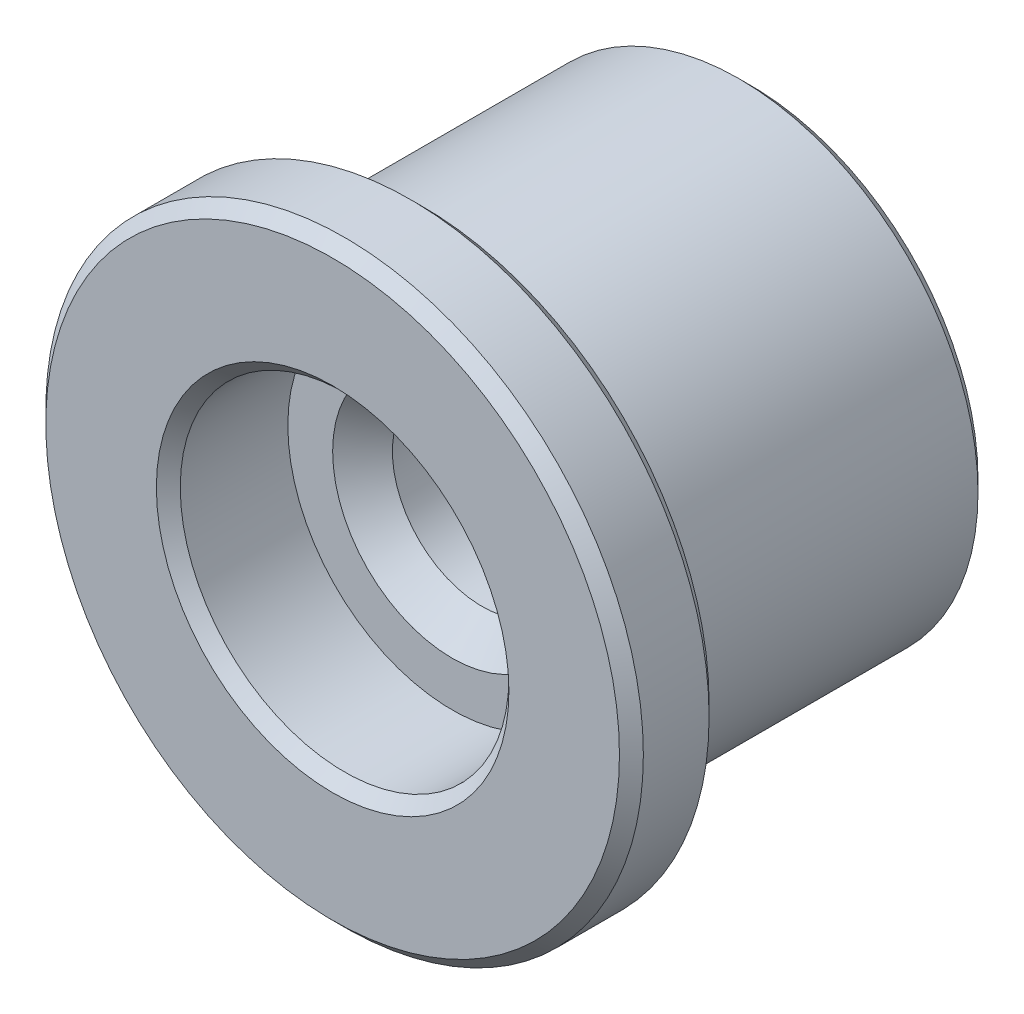
ISO-10303-21;
HEADER;
FILE_DESCRIPTION(('STEP AP214'),'2;1');
FILE_NAME('part.step','',(''),(''),'','','');
FILE_SCHEMA(('AUTOMOTIVE_DESIGN { 1 0 10303 214 1 1 1 1 }'));
ENDSEC;
DATA;
#1=APPLICATION_CONTEXT('core data for automotive mechanical design processes');
#2=APPLICATION_PROTOCOL_DEFINITION('international standard','automotive_design',2000,#1);
#3=PRODUCT_CONTEXT('',#1,'mechanical');
#4=PRODUCT('Part','Part','',(#3));
#5=PRODUCT_RELATED_PRODUCT_CATEGORY('part','',(#4));
#6=PRODUCT_DEFINITION_FORMATION('','',#4);
#7=PRODUCT_DEFINITION_CONTEXT('part definition',#1,'design');
#8=PRODUCT_DEFINITION('design','',#6,#7);
#9=PRODUCT_DEFINITION_SHAPE('','',#8);
#10=(LENGTH_UNIT() NAMED_UNIT(*) SI_UNIT(.MILLI.,.METRE.));
#11=(NAMED_UNIT(*) PLANE_ANGLE_UNIT() SI_UNIT($,.RADIAN.));
#12=(NAMED_UNIT(*) SI_UNIT($,.STERADIAN.) SOLID_ANGLE_UNIT());
#13=UNCERTAINTY_MEASURE_WITH_UNIT(LENGTH_MEASURE(1.E-05),#10,'distance_accuracy_value','');
#14=(GEOMETRIC_REPRESENTATION_CONTEXT(3) GLOBAL_UNCERTAINTY_ASSIGNED_CONTEXT((#13)) GLOBAL_UNIT_ASSIGNED_CONTEXT((#10,
#11,#12)) REPRESENTATION_CONTEXT('',''));
#15=CARTESIAN_POINT('',(0.,0.,0.));
#16=DIRECTION('',(0.,0.,1.));
#17=DIRECTION('',(1.,0.,0.));
#18=AXIS2_PLACEMENT_3D('',#15,#16,#17);
#19=CARTESIAN_POINT('',(0.,0.,5.5));
#20=DIRECTION('',(0.,0.,-1.));
#21=DIRECTION('',(-1.,0.,0.));
#22=AXIS2_PLACEMENT_3D('',#19,#20,#21);
#23=CYLINDRICAL_SURFACE('',#22,4.);
#24=CARTESIAN_POINT('',(0.,0.,0.200000000000004));
#25=DIRECTION('',(0.,0.,1.));
#26=DIRECTION('',(1.,0.,0.));
#27=AXIS2_PLACEMENT_3D('',#24,#25,#26);
#28=CIRCLE('',#27,4.);
#29=CARTESIAN_POINT('',(4.,0.,0.200000000000004));
#30=VERTEX_POINT('',#29);
#31=EDGE_CURVE('E61',#30,#30,#28,.T.);
#32=ORIENTED_EDGE('',*,*,#31,.T.);
#33=EDGE_LOOP('',(#32));
#34=FACE_BOUND('',#33,.T.);
#35=CARTESIAN_POINT('',(0.,0.,5.5));
#36=DIRECTION('',(0.,0.,1.));
#37=DIRECTION('',(1.,0.,0.));
#38=AXIS2_PLACEMENT_3D('',#35,#36,#37);
#39=CIRCLE('',#38,4.);
#40=CARTESIAN_POINT('',(4.,0.,5.5));
#41=VERTEX_POINT('',#40);
#42=EDGE_CURVE('E76',#41,#41,#39,.T.);
#43=ORIENTED_EDGE('',*,*,#42,.F.);
#44=EDGE_LOOP('',(#43));
#45=FACE_BOUND('',#44,.T.);
#46=ADVANCED_FACE('F32',(#34,#45),#23,.T.);
#47=CARTESIAN_POINT('',(0.,0.,0.));
#48=DIRECTION('',(0.,0.,1.));
#49=DIRECTION('',(1.,0.,0.));
#50=AXIS2_PLACEMENT_3D('',#47,#48,#49);
#51=PLANE('',#50);
#52=CARTESIAN_POINT('',(0.,0.,0.));
#53=DIRECTION('',(0.,0.,1.));
#54=DIRECTION('',(1.,0.,0.));
#55=AXIS2_PLACEMENT_3D('',#52,#53,#54);
#56=CIRCLE('',#55,2.00000000000001);
#57=CARTESIAN_POINT('',(2.00000000000001,0.,0.));
#58=VERTEX_POINT('',#57);
#59=EDGE_CURVE('E39',#58,#58,#56,.T.);
#60=ORIENTED_EDGE('',*,*,#59,.T.);
#61=EDGE_LOOP('',(#60));
#62=FACE_BOUND('',#61,.T.);
#63=CARTESIAN_POINT('',(0.,0.,0.));
#64=DIRECTION('',(0.,0.,1.));
#65=DIRECTION('',(1.,0.,0.));
#66=AXIS2_PLACEMENT_3D('',#63,#64,#65);
#67=CIRCLE('',#66,3.8);
#68=CARTESIAN_POINT('',(3.8,0.,0.));
#69=VERTEX_POINT('',#68);
#70=EDGE_CURVE('E58',#69,#69,#67,.F.);
#71=ORIENTED_EDGE('',*,*,#70,.T.);
#72=EDGE_LOOP('',(#71));
#73=FACE_BOUND('',#72,.T.);
#74=ADVANCED_FACE('F100',(#62,#73),#51,.F.);
#75=CARTESIAN_POINT('',(0.,0.,5.5));
#76=DIRECTION('',(0.,0.,1.));
#77=DIRECTION('',(1.,0.,0.));
#78=AXIS2_PLACEMENT_3D('',#75,#76,#77);
#79=PLANE('',#78);
#80=CARTESIAN_POINT('',(0.,0.,5.5));
#81=DIRECTION('',(0.,0.,1.));
#82=DIRECTION('',(1.,0.,0.));
#83=AXIS2_PLACEMENT_3D('',#80,#81,#82);
#84=CIRCLE('',#83,4.8);
#85=CARTESIAN_POINT('',(4.8,0.,5.5));
#86=VERTEX_POINT('',#85);
#87=EDGE_CURVE('E67',#86,#86,#84,.F.);
#88=ORIENTED_EDGE('',*,*,#87,.T.);
#89=EDGE_LOOP('',(#88));
#90=FACE_BOUND('',#89,.T.);
#91=ORIENTED_EDGE('',*,*,#42,.T.);
#92=EDGE_LOOP('',(#91));
#93=FACE_BOUND('',#92,.T.);
#94=ADVANCED_FACE('F106',(#90,#93),#79,.F.);
#95=CARTESIAN_POINT('',(0.,0.,7.));
#96=DIRECTION('',(0.,0.,-1.));
#97=DIRECTION('',(-1.,0.,0.));
#98=AXIS2_PLACEMENT_3D('',#95,#96,#97);
#99=CYLINDRICAL_SURFACE('',#98,5.);
#100=CARTESIAN_POINT('',(0.,0.,5.7));
#101=DIRECTION('',(0.,0.,1.));
#102=DIRECTION('',(1.,0.,0.));
#103=AXIS2_PLACEMENT_3D('',#100,#101,#102);
#104=CIRCLE('',#103,5.);
#105=CARTESIAN_POINT('',(5.,0.,5.7));
#106=VERTEX_POINT('',#105);
#107=EDGE_CURVE('E70',#106,#106,#104,.T.);
#108=ORIENTED_EDGE('',*,*,#107,.T.);
#109=EDGE_LOOP('',(#108));
#110=FACE_BOUND('',#109,.T.);
#111=CARTESIAN_POINT('',(0.,0.,6.79999999999999));
#112=DIRECTION('',(0.,0.,1.));
#113=DIRECTION('',(1.,0.,0.));
#114=AXIS2_PLACEMENT_3D('',#111,#112,#113);
#115=CIRCLE('',#114,5.);
#116=CARTESIAN_POINT('',(5.,0.,6.79999999999999));
#117=VERTEX_POINT('',#116);
#118=EDGE_CURVE('E73',#117,#117,#115,.F.);
#119=ORIENTED_EDGE('',*,*,#118,.T.);
#120=EDGE_LOOP('',(#119));
#121=FACE_BOUND('',#120,.T.);
#122=ADVANCED_FACE('F96',(#110,#121),#99,.T.);
#123=CARTESIAN_POINT('',(0.,0.,7.));
#124=DIRECTION('',(0.,0.,1.));
#125=DIRECTION('',(1.,0.,0.));
#126=AXIS2_PLACEMENT_3D('',#123,#124,#125);
#127=PLANE('',#126);
#128=CARTESIAN_POINT('',(0.,0.,7.));
#129=DIRECTION('',(0.,0.,1.));
#130=DIRECTION('',(1.,0.,0.));
#131=AXIS2_PLACEMENT_3D('',#128,#129,#130);
#132=CIRCLE('',#131,2.95);
#133=CARTESIAN_POINT('',(2.95,0.,7.));
#134=VERTEX_POINT('',#133);
#135=EDGE_CURVE('E52',#134,#134,#132,.F.);
#136=ORIENTED_EDGE('',*,*,#135,.T.);
#137=EDGE_LOOP('',(#136));
#138=FACE_BOUND('',#137,.T.);
#139=CARTESIAN_POINT('',(0.,0.,7.));
#140=DIRECTION('',(0.,0.,1.));
#141=DIRECTION('',(1.,0.,0.));
#142=AXIS2_PLACEMENT_3D('',#139,#140,#141);
#143=CIRCLE('',#142,4.8);
#144=CARTESIAN_POINT('',(4.8,0.,7.));
#145=VERTEX_POINT('',#144);
#146=EDGE_CURVE('E64',#145,#145,#143,.T.);
#147=ORIENTED_EDGE('',*,*,#146,.T.);
#148=EDGE_LOOP('',(#147));
#149=FACE_BOUND('',#148,.T.);
#150=ADVANCED_FACE('F87',(#138,#149),#127,.T.);
#151=CARTESIAN_POINT('',(0.,0.,5.));
#152=DIRECTION('',(0.,0.,1.));
#153=DIRECTION('',(1.,0.,0.));
#154=AXIS2_PLACEMENT_3D('',#151,#152,#153);
#155=CYLINDRICAL_SURFACE('',#154,2.75);
#156=CARTESIAN_POINT('',(0.,0.,6.8));
#157=DIRECTION('',(0.,0.,1.));
#158=DIRECTION('',(1.,0.,0.));
#159=AXIS2_PLACEMENT_3D('',#156,#157,#158);
#160=CIRCLE('',#159,2.75);
#161=CARTESIAN_POINT('',(2.75,0.,6.8));
#162=VERTEX_POINT('',#161);
#163=EDGE_CURVE('E55',#162,#162,#160,.T.);
#164=ORIENTED_EDGE('',*,*,#163,.T.);
#165=EDGE_LOOP('',(#164));
#166=FACE_BOUND('',#165,.T.);
#167=CARTESIAN_POINT('',(0.,0.,5.));
#168=DIRECTION('',(0.,0.,1.));
#169=DIRECTION('',(1.,0.,0.));
#170=AXIS2_PLACEMENT_3D('',#167,#168,#169);
#171=CIRCLE('',#170,2.75);
#172=CARTESIAN_POINT('',(2.75,0.,5.));
#173=VERTEX_POINT('',#172);
#174=EDGE_CURVE('E79',#173,#173,#171,.T.);
#175=ORIENTED_EDGE('',*,*,#174,.F.);
#176=EDGE_LOOP('',(#175));
#177=FACE_BOUND('',#176,.T.);
#178=ADVANCED_FACE('F85',(#166,#177),#155,.F.);
#179=CARTESIAN_POINT('',(0.,0.,5.));
#180=DIRECTION('',(0.,0.,1.));
#181=DIRECTION('',(1.,0.,0.));
#182=AXIS2_PLACEMENT_3D('',#179,#180,#181);
#183=PLANE('',#182);
#184=CARTESIAN_POINT('',(0.,0.,5.));
#185=DIRECTION('',(0.,0.,1.));
#186=DIRECTION('',(1.,0.,0.));
#187=AXIS2_PLACEMENT_3D('',#184,#185,#186);
#188=CIRCLE('',#187,2.00000000000001);
#189=CARTESIAN_POINT('',(2.00000000000001,0.,5.));
#190=VERTEX_POINT('',#189);
#191=EDGE_CURVE('E10',#190,#190,#188,.F.);
#192=ORIENTED_EDGE('',*,*,#191,.T.);
#193=EDGE_LOOP('',(#192));
#194=FACE_BOUND('',#193,.T.);
#195=ORIENTED_EDGE('',*,*,#174,.T.);
#196=EDGE_LOOP('',(#195));
#197=FACE_BOUND('',#196,.T.);
#198=ADVANCED_FACE('F83',(#194,#197),#183,.T.);
#199=CARTESIAN_POINT('',(0.,0.,7.));
#200=DIRECTION('',(0.,0.,-1.));
#201=DIRECTION('',(-1.,0.,0.));
#202=AXIS2_PLACEMENT_3D('',#199,#200,#201);
#203=CYLINDRICAL_SURFACE('',#202,1.5);
#204=CARTESIAN_POINT('',(0.,0.,0.500000000000008));
#205=DIRECTION('',(0.,0.,1.));
#206=DIRECTION('',(1.,0.,0.));
#207=AXIS2_PLACEMENT_3D('',#204,#205,#206);
#208=CIRCLE('',#207,1.5);
#209=CARTESIAN_POINT('',(1.5,0.,0.500000000000008));
#210=VERTEX_POINT('',#209);
#211=EDGE_CURVE('E43',#210,#210,#208,.F.);
#212=ORIENTED_EDGE('',*,*,#211,.T.);
#213=EDGE_LOOP('',(#212));
#214=FACE_BOUND('',#213,.T.);
#215=CARTESIAN_POINT('',(0.,0.,4.49999999999999));
#216=DIRECTION('',(0.,0.,1.));
#217=DIRECTION('',(1.,0.,0.));
#218=AXIS2_PLACEMENT_3D('',#215,#216,#217);
#219=CIRCLE('',#218,1.5);
#220=CARTESIAN_POINT('',(1.5,0.,4.49999999999999));
#221=VERTEX_POINT('',#220);
#222=EDGE_CURVE('E47',#221,#221,#219,.T.);
#223=ORIENTED_EDGE('',*,*,#222,.T.);
#224=EDGE_LOOP('',(#223));
#225=FACE_BOUND('',#224,.T.);
#226=ADVANCED_FACE('F94',(#214,#225),#203,.F.);
#227=CARTESIAN_POINT('',(0.,0.,5.7));
#228=DIRECTION('',(0.,0.,1.));
#229=DIRECTION('',(1.,0.,0.));
#230=AXIS2_PLACEMENT_3D('',#227,#228,#229);
#231=CONICAL_SURFACE('',#230,5.,0.78539816339745);
#232=ORIENTED_EDGE('',*,*,#87,.F.);
#233=EDGE_LOOP('',(#232));
#234=FACE_BOUND('',#233,.T.);
#235=ORIENTED_EDGE('',*,*,#107,.F.);
#236=EDGE_LOOP('',(#235));
#237=FACE_BOUND('',#236,.T.);
#238=ADVANCED_FACE('F111',(#234,#237),#231,.T.);
#239=CARTESIAN_POINT('',(0.,0.,7.));
#240=DIRECTION('',(0.,0.,-1.));
#241=DIRECTION('',(-1.,0.,0.));
#242=AXIS2_PLACEMENT_3D('',#239,#240,#241);
#243=CONICAL_SURFACE('',#242,4.8,0.785398163397444);
#244=ORIENTED_EDGE('',*,*,#118,.F.);
#245=EDGE_LOOP('',(#244));
#246=FACE_BOUND('',#245,.T.);
#247=ORIENTED_EDGE('',*,*,#146,.F.);
#248=EDGE_LOOP('',(#247));
#249=FACE_BOUND('',#248,.T.);
#250=ADVANCED_FACE('F114',(#246,#249),#243,.T.);
#251=CARTESIAN_POINT('',(0.,0.,0.200000000000004));
#252=DIRECTION('',(0.,0.,1.));
#253=DIRECTION('',(1.,0.,0.));
#254=AXIS2_PLACEMENT_3D('',#251,#252,#253);
#255=CONICAL_SURFACE('',#254,4.,0.785398163397446);
#256=ORIENTED_EDGE('',*,*,#70,.F.);
#257=EDGE_LOOP('',(#256));
#258=FACE_BOUND('',#257,.T.);
#259=ORIENTED_EDGE('',*,*,#31,.F.);
#260=EDGE_LOOP('',(#259));
#261=FACE_BOUND('',#260,.T.);
#262=ADVANCED_FACE('F118',(#258,#261),#255,.T.);
#263=CARTESIAN_POINT('',(0.,0.,6.8));
#264=DIRECTION('',(0.,0.,1.));
#265=DIRECTION('',(1.,0.,0.));
#266=AXIS2_PLACEMENT_3D('',#263,#264,#265);
#267=CONICAL_SURFACE('',#266,2.75,0.78539816339745);
#268=ORIENTED_EDGE('',*,*,#135,.F.);
#269=EDGE_LOOP('',(#268));
#270=FACE_BOUND('',#269,.T.);
#271=ORIENTED_EDGE('',*,*,#163,.F.);
#272=EDGE_LOOP('',(#271));
#273=FACE_BOUND('',#272,.T.);
#274=ADVANCED_FACE('F122',(#270,#273),#267,.F.);
#275=CARTESIAN_POINT('',(0.,0.,0.500000000000008));
#276=DIRECTION('',(0.,0.,-1.));
#277=DIRECTION('',(-1.,0.,0.));
#278=AXIS2_PLACEMENT_3D('',#275,#276,#277);
#279=CONICAL_SURFACE('',#278,1.5,0.785398163397452);
#280=ORIENTED_EDGE('',*,*,#59,.F.);
#281=EDGE_LOOP('',(#280));
#282=FACE_BOUND('',#281,.T.);
#283=ORIENTED_EDGE('',*,*,#211,.F.);
#284=EDGE_LOOP('',(#283));
#285=FACE_BOUND('',#284,.T.);
#286=ADVANCED_FACE('F125',(#282,#285),#279,.F.);
#287=CARTESIAN_POINT('',(0.,0.,4.49999999999999));
#288=DIRECTION('',(0.,0.,1.));
#289=DIRECTION('',(1.,0.,0.));
#290=AXIS2_PLACEMENT_3D('',#287,#288,#289);
#291=CONICAL_SURFACE('',#290,1.5,0.785398163397452);
#292=ORIENTED_EDGE('',*,*,#191,.F.);
#293=EDGE_LOOP('',(#292));
#294=FACE_BOUND('',#293,.T.);
#295=ORIENTED_EDGE('',*,*,#222,.F.);
#296=EDGE_LOOP('',(#295));
#297=FACE_BOUND('',#296,.T.);
#298=ADVANCED_FACE('F34',(#294,#297),#291,.F.);
#299=CLOSED_SHELL('',(#46,#74,#94,#122,#150,#178,#198,#226,#238,#250,#262,#274,#286,#298));
#300=MANIFOLD_SOLID_BREP('B2',#299);
#301=ADVANCED_BREP_SHAPE_REPRESENTATION('',(#18,#300),#14);
#302=SHAPE_DEFINITION_REPRESENTATION(#9,#301);
ENDSEC;
END-ISO-10303-21;
